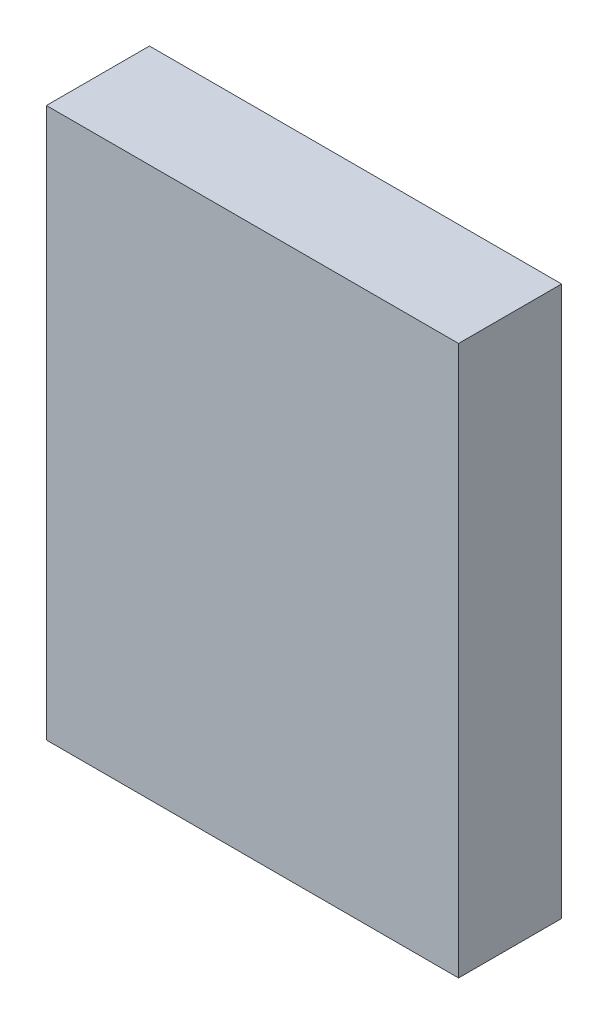
ISO-10303-21;
HEADER;
FILE_DESCRIPTION(('STEP AP214'),'2;1');
FILE_NAME('part.step','',(''),(''),'','','');
FILE_SCHEMA(('AUTOMOTIVE_DESIGN { 1 0 10303 214 1 1 1 1 }'));
ENDSEC;
DATA;
#1=APPLICATION_CONTEXT('core data for automotive mechanical design processes');
#2=APPLICATION_PROTOCOL_DEFINITION('international standard','automotive_design',2000,#1);
#3=PRODUCT_CONTEXT('',#1,'mechanical');
#4=PRODUCT('Part','Part','',(#3));
#5=PRODUCT_RELATED_PRODUCT_CATEGORY('part','',(#4));
#6=PRODUCT_DEFINITION_FORMATION('','',#4);
#7=PRODUCT_DEFINITION_CONTEXT('part definition',#1,'design');
#8=PRODUCT_DEFINITION('design','',#6,#7);
#9=PRODUCT_DEFINITION_SHAPE('','',#8);
#10=(LENGTH_UNIT() NAMED_UNIT(*) SI_UNIT(.MILLI.,.METRE.));
#11=(NAMED_UNIT(*) PLANE_ANGLE_UNIT() SI_UNIT($,.RADIAN.));
#12=(NAMED_UNIT(*) SI_UNIT($,.STERADIAN.) SOLID_ANGLE_UNIT());
#13=UNCERTAINTY_MEASURE_WITH_UNIT(LENGTH_MEASURE(1.E-05),#10,'distance_accuracy_value','');
#14=(GEOMETRIC_REPRESENTATION_CONTEXT(3) GLOBAL_UNCERTAINTY_ASSIGNED_CONTEXT((#13)) GLOBAL_UNIT_ASSIGNED_CONTEXT((#10,
#11,#12)) REPRESENTATION_CONTEXT('',''));
#15=CARTESIAN_POINT('',(0.,0.,0.));
#16=DIRECTION('',(0.,0.,1.));
#17=DIRECTION('',(1.,0.,0.));
#18=AXIS2_PLACEMENT_3D('',#15,#16,#17);
#19=CARTESIAN_POINT('',(1.50000208,-2.00000108,0.));
#20=DIRECTION('',(0.,-1.,0.));
#21=DIRECTION('',(-1.,0.,0.));
#22=AXIS2_PLACEMENT_3D('',#19,#20,#21);
#23=PLANE('',#22);
#24=DIRECTION('',(0.,0.,1.));
#25=VECTOR('',#24,1.);
#26=CARTESIAN_POINT('',(1.50000208,-2.00000108,0.));
#27=LINE('',#26,#25);
#28=CARTESIAN_POINT('',(1.50000208,-2.00000108,0.));
#29=VERTEX_POINT('',#28);
#30=CARTESIAN_POINT('',(1.50000208,-2.00000108,0.75000104));
#31=VERTEX_POINT('',#30);
#32=EDGE_CURVE('E10',#29,#31,#27,.T.);
#33=ORIENTED_EDGE('',*,*,#32,.T.);
#34=DIRECTION('',(-1.,0.,0.));
#35=VECTOR('',#34,1.);
#36=CARTESIAN_POINT('',(1.50000208,-2.00000108,0.75000104));
#37=LINE('',#36,#35);
#38=CARTESIAN_POINT('',(-1.499997,-2.00000108,0.75000104));
#39=VERTEX_POINT('',#38);
#40=EDGE_CURVE('E23',#31,#39,#37,.T.);
#41=ORIENTED_EDGE('',*,*,#40,.T.);
#42=DIRECTION('',(0.,0.,1.));
#43=VECTOR('',#42,1.);
#44=CARTESIAN_POINT('',(-1.499997,-2.00000108,0.));
#45=LINE('',#44,#43);
#46=CARTESIAN_POINT('',(-1.499997,-2.00000108,0.));
#47=VERTEX_POINT('',#46);
#48=EDGE_CURVE('E83',#47,#39,#45,.T.);
#49=ORIENTED_EDGE('',*,*,#48,.F.);
#50=DIRECTION('',(-1.,0.,0.));
#51=VECTOR('',#50,1.);
#52=CARTESIAN_POINT('',(1.50000208,-2.00000108,0.));
#53=LINE('',#52,#51);
#54=EDGE_CURVE('E81',#29,#47,#53,.T.);
#55=ORIENTED_EDGE('',*,*,#54,.F.);
#56=EDGE_LOOP('',(#33,#41,#49,#55));
#57=FACE_BOUND('',#56,.T.);
#58=ADVANCED_FACE('F16',(#57),#23,.T.);
#59=CARTESIAN_POINT('',(-1.499997,-2.00000108,0.));
#60=DIRECTION('',(-1.,0.,0.));
#61=DIRECTION('',(0.,1.,0.));
#62=AXIS2_PLACEMENT_3D('',#59,#60,#61);
#63=PLANE('',#62);
#64=ORIENTED_EDGE('',*,*,#48,.T.);
#65=DIRECTION('',(0.,1.,0.));
#66=VECTOR('',#65,1.);
#67=CARTESIAN_POINT('',(-1.499997,-2.00000108,0.75000104));
#68=LINE('',#67,#66);
#69=CARTESIAN_POINT('',(-1.499997,2.00000108,0.75000104));
#70=VERTEX_POINT('',#69);
#71=EDGE_CURVE('E78',#39,#70,#68,.T.);
#72=ORIENTED_EDGE('',*,*,#71,.T.);
#73=DIRECTION('',(0.,0.,1.));
#74=VECTOR('',#73,1.);
#75=CARTESIAN_POINT('',(-1.499997,2.00000108,0.));
#76=LINE('',#75,#74);
#77=CARTESIAN_POINT('',(-1.499997,2.00000108,0.));
#78=VERTEX_POINT('',#77);
#79=EDGE_CURVE('E76',#78,#70,#76,.T.);
#80=ORIENTED_EDGE('',*,*,#79,.F.);
#81=DIRECTION('',(0.,1.,0.));
#82=VECTOR('',#81,1.);
#83=CARTESIAN_POINT('',(-1.499997,-2.00000108,0.));
#84=LINE('',#83,#82);
#85=EDGE_CURVE('E67',#47,#78,#84,.T.);
#86=ORIENTED_EDGE('',*,*,#85,.F.);
#87=EDGE_LOOP('',(#64,#72,#80,#86));
#88=FACE_BOUND('',#87,.T.);
#89=ADVANCED_FACE('F89',(#88),#63,.T.);
#90=CARTESIAN_POINT('',(-1.499997,2.00000108,0.));
#91=DIRECTION('',(0.,1.,0.));
#92=DIRECTION('',(1.,0.,0.));
#93=AXIS2_PLACEMENT_3D('',#90,#91,#92);
#94=PLANE('',#93);
#95=ORIENTED_EDGE('',*,*,#79,.T.);
#96=DIRECTION('',(1.,0.,0.));
#97=VECTOR('',#96,1.);
#98=CARTESIAN_POINT('',(-1.499997,2.00000108,0.75000104));
#99=LINE('',#98,#97);
#100=CARTESIAN_POINT('',(1.50000208,2.00000108,0.75000104));
#101=VERTEX_POINT('',#100);
#102=EDGE_CURVE('E59',#70,#101,#99,.T.);
#103=ORIENTED_EDGE('',*,*,#102,.T.);
#104=DIRECTION('',(0.,0.,1.));
#105=VECTOR('',#104,1.);
#106=CARTESIAN_POINT('',(1.50000208,2.00000108,0.));
#107=LINE('',#106,#105);
#108=CARTESIAN_POINT('',(1.50000208,2.00000108,0.));
#109=VERTEX_POINT('',#108);
#110=EDGE_CURVE('E53',#109,#101,#107,.T.);
#111=ORIENTED_EDGE('',*,*,#110,.F.);
#112=DIRECTION('',(1.,0.,0.));
#113=VECTOR('',#112,1.);
#114=CARTESIAN_POINT('',(-1.499997,2.00000108,0.));
#115=LINE('',#114,#113);
#116=EDGE_CURVE('E57',#78,#109,#115,.T.);
#117=ORIENTED_EDGE('',*,*,#116,.F.);
#118=EDGE_LOOP('',(#95,#103,#111,#117));
#119=FACE_BOUND('',#118,.T.);
#120=ADVANCED_FACE('F56',(#119),#94,.T.);
#121=CARTESIAN_POINT('',(1.50000208,2.00000108,0.));
#122=DIRECTION('',(1.,0.,0.));
#123=DIRECTION('',(0.,-1.,0.));
#124=AXIS2_PLACEMENT_3D('',#121,#122,#123);
#125=PLANE('',#124);
#126=ORIENTED_EDGE('',*,*,#110,.T.);
#127=DIRECTION('',(0.,-1.,0.));
#128=VECTOR('',#127,1.);
#129=CARTESIAN_POINT('',(1.50000208,2.00000108,0.75000104));
#130=LINE('',#129,#128);
#131=EDGE_CURVE('E68',#101,#31,#130,.T.);
#132=ORIENTED_EDGE('',*,*,#131,.T.);
#133=ORIENTED_EDGE('',*,*,#32,.F.);
#134=DIRECTION('',(0.,-1.,0.));
#135=VECTOR('',#134,1.);
#136=CARTESIAN_POINT('',(1.50000208,2.00000108,0.));
#137=LINE('',#136,#135);
#138=EDGE_CURVE('E66',#109,#29,#137,.T.);
#139=ORIENTED_EDGE('',*,*,#138,.F.);
#140=EDGE_LOOP('',(#126,#132,#133,#139));
#141=FACE_BOUND('',#140,.T.);
#142=ADVANCED_FACE('F70',(#141),#125,.T.);
#143=CARTESIAN_POINT('',(2.54000000704198E-06,0.,0.));
#144=DIRECTION('',(0.,0.,-1.));
#145=DIRECTION('',(-1.,0.,0.));
#146=AXIS2_PLACEMENT_3D('',#143,#144,#145);
#147=PLANE('',#146);
#148=ORIENTED_EDGE('',*,*,#54,.T.);
#149=ORIENTED_EDGE('',*,*,#85,.T.);
#150=ORIENTED_EDGE('',*,*,#116,.T.);
#151=ORIENTED_EDGE('',*,*,#138,.T.);
#152=EDGE_LOOP('',(#148,#149,#150,#151));
#153=FACE_BOUND('',#152,.T.);
#154=ADVANCED_FACE('F65',(#153),#147,.T.);
#155=CARTESIAN_POINT('',(2.54000000704198E-06,0.,0.75000104));
#156=DIRECTION('',(0.,0.,-1.));
#157=DIRECTION('',(-1.,0.,0.));
#158=AXIS2_PLACEMENT_3D('',#155,#156,#157);
#159=PLANE('',#158);
#160=ORIENTED_EDGE('',*,*,#131,.F.);
#161=ORIENTED_EDGE('',*,*,#102,.F.);
#162=ORIENTED_EDGE('',*,*,#71,.F.);
#163=ORIENTED_EDGE('',*,*,#40,.F.);
#164=EDGE_LOOP('',(#160,#161,#162,#163));
#165=FACE_BOUND('',#164,.T.);
#166=ADVANCED_FACE('F90',(#165),#159,.F.);
#167=CLOSED_SHELL('',(#58,#89,#120,#142,#154,#166));
#168=MANIFOLD_SOLID_BREP('B1',#167);
#169=ADVANCED_BREP_SHAPE_REPRESENTATION('',(#18,#168),#14);
#170=SHAPE_DEFINITION_REPRESENTATION(#9,#169);
ENDSEC;
END-ISO-10303-21;
